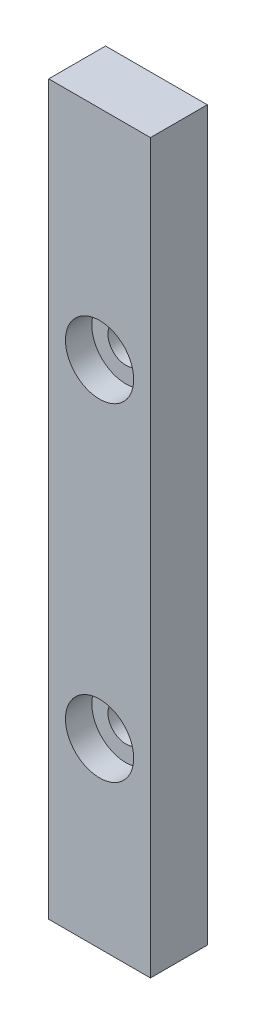
ISO-10303-21;
HEADER;
FILE_DESCRIPTION(('STEP AP214'),'2;1');
FILE_NAME('part.step','',(''),(''),'','','');
FILE_SCHEMA(('AUTOMOTIVE_DESIGN { 1 0 10303 214 1 1 1 1 }'));
ENDSEC;
DATA;
#1=APPLICATION_CONTEXT('core data for automotive mechanical design processes');
#2=APPLICATION_PROTOCOL_DEFINITION('international standard','automotive_design',2000,#1);
#3=PRODUCT_CONTEXT('',#1,'mechanical');
#4=PRODUCT('Part','Part','',(#3));
#5=PRODUCT_RELATED_PRODUCT_CATEGORY('part','',(#4));
#6=PRODUCT_DEFINITION_FORMATION('','',#4);
#7=PRODUCT_DEFINITION_CONTEXT('part definition',#1,'design');
#8=PRODUCT_DEFINITION('design','',#6,#7);
#9=PRODUCT_DEFINITION_SHAPE('','',#8);
#10=(LENGTH_UNIT() NAMED_UNIT(*) SI_UNIT(.MILLI.,.METRE.));
#11=(NAMED_UNIT(*) PLANE_ANGLE_UNIT() SI_UNIT($,.RADIAN.));
#12=(NAMED_UNIT(*) SI_UNIT($,.STERADIAN.) SOLID_ANGLE_UNIT());
#13=UNCERTAINTY_MEASURE_WITH_UNIT(LENGTH_MEASURE(1.E-05),#10,'distance_accuracy_value','');
#14=(GEOMETRIC_REPRESENTATION_CONTEXT(3) GLOBAL_UNCERTAINTY_ASSIGNED_CONTEXT((#13)) GLOBAL_UNIT_ASSIGNED_CONTEXT((#10,
#11,#12)) REPRESENTATION_CONTEXT('',''));
#15=CARTESIAN_POINT('',(0.,0.,0.));
#16=DIRECTION('',(0.,0.,1.));
#17=DIRECTION('',(1.,0.,0.));
#18=AXIS2_PLACEMENT_3D('',#15,#16,#17);
#19=CARTESIAN_POINT('',(4.25,-45.6,4.75));
#20=DIRECTION('',(0.,0.,1.));
#21=DIRECTION('',(1.,0.,0.));
#22=AXIS2_PLACEMENT_3D('',#19,#20,#21);
#23=CYLINDRICAL_SURFACE('',#22,1.5);
#24=CARTESIAN_POINT('',(4.25,-45.6,0.));
#25=DIRECTION('',(0.,0.,1.));
#26=DIRECTION('',(1.,0.,0.));
#27=AXIS2_PLACEMENT_3D('',#24,#25,#26);
#28=CIRCLE('',#27,1.5);
#29=CARTESIAN_POINT('',(5.75,-45.6,0.));
#30=VERTEX_POINT('',#29);
#31=EDGE_CURVE('E115',#30,#30,#28,.T.);
#32=ORIENTED_EDGE('',*,*,#31,.F.);
#33=EDGE_LOOP('',(#32));
#34=FACE_BOUND('',#33,.T.);
#35=CARTESIAN_POINT('',(4.25,-45.6,2.55));
#36=DIRECTION('',(0.,0.,1.));
#37=DIRECTION('',(1.,0.,0.));
#38=AXIS2_PLACEMENT_3D('',#35,#36,#37);
#39=CIRCLE('',#38,1.5);
#40=CARTESIAN_POINT('',(5.75,-45.6,2.55));
#41=VERTEX_POINT('',#40);
#42=EDGE_CURVE('E43',#41,#41,#39,.F.);
#43=ORIENTED_EDGE('',*,*,#42,.F.);
#44=EDGE_LOOP('',(#43));
#45=FACE_BOUND('',#44,.T.);
#46=ADVANCED_FACE('F39',(#34,#45),#23,.F.);
#47=CARTESIAN_POINT('',(4.25000000000001,-18.2,4.75));
#48=DIRECTION('',(0.,0.,1.));
#49=DIRECTION('',(1.,0.,0.));
#50=AXIS2_PLACEMENT_3D('',#47,#48,#49);
#51=CYLINDRICAL_SURFACE('',#50,1.5);
#52=CARTESIAN_POINT('',(4.25000000000001,-18.2,0.));
#53=DIRECTION('',(0.,0.,1.));
#54=DIRECTION('',(1.,0.,0.));
#55=AXIS2_PLACEMENT_3D('',#52,#53,#54);
#56=CIRCLE('',#55,1.5);
#57=CARTESIAN_POINT('',(5.75000000000001,-18.2,0.));
#58=VERTEX_POINT('',#57);
#59=EDGE_CURVE('E129',#58,#58,#56,.T.);
#60=ORIENTED_EDGE('',*,*,#59,.F.);
#61=EDGE_LOOP('',(#60));
#62=FACE_BOUND('',#61,.T.);
#63=CARTESIAN_POINT('',(4.25000000000001,-18.2,2.55));
#64=DIRECTION('',(0.,0.,1.));
#65=DIRECTION('',(1.,0.,0.));
#66=AXIS2_PLACEMENT_3D('',#63,#64,#65);
#67=CIRCLE('',#66,1.5);
#68=CARTESIAN_POINT('',(5.75000000000001,-18.2,2.55));
#69=VERTEX_POINT('',#68);
#70=EDGE_CURVE('E132',#69,#69,#67,.F.);
#71=ORIENTED_EDGE('',*,*,#70,.F.);
#72=EDGE_LOOP('',(#71));
#73=FACE_BOUND('',#72,.T.);
#74=ADVANCED_FACE('F178',(#62,#73),#51,.F.);
#75=CARTESIAN_POINT('',(0.,0.,4.75));
#76=DIRECTION('',(1.,0.,0.));
#77=DIRECTION('',(0.,1.,0.));
#78=AXIS2_PLACEMENT_3D('',#75,#76,#77);
#79=PLANE('',#78);
#80=DIRECTION('',(0.,-1.,0.));
#81=VECTOR('',#80,1.);
#82=CARTESIAN_POINT('',(0.,0.,0.));
#83=LINE('',#82,#81);
#84=CARTESIAN_POINT('',(0.,0.,0.));
#85=VERTEX_POINT('',#84);
#86=CARTESIAN_POINT('',(0.,-60.8,0.));
#87=VERTEX_POINT('',#86);
#88=EDGE_CURVE('E111',#85,#87,#83,.T.);
#89=ORIENTED_EDGE('',*,*,#88,.T.);
#90=DIRECTION('',(0.,0.,-1.));
#91=VECTOR('',#90,1.);
#92=CARTESIAN_POINT('',(0.,-60.8,4.75));
#93=LINE('',#92,#91);
#94=CARTESIAN_POINT('',(0.,-60.8,4.75));
#95=VERTEX_POINT('',#94);
#96=EDGE_CURVE('E11',#95,#87,#93,.T.);
#97=ORIENTED_EDGE('',*,*,#96,.F.);
#98=DIRECTION('',(0.,-1.,0.));
#99=VECTOR('',#98,1.);
#100=CARTESIAN_POINT('',(0.,0.,4.75));
#101=LINE('',#100,#99);
#102=CARTESIAN_POINT('',(0.,0.,4.75));
#103=VERTEX_POINT('',#102);
#104=EDGE_CURVE('E94',#103,#95,#101,.T.);
#105=ORIENTED_EDGE('',*,*,#104,.F.);
#106=DIRECTION('',(0.,0.,-1.));
#107=VECTOR('',#106,1.);
#108=CARTESIAN_POINT('',(0.,0.,4.75));
#109=LINE('',#108,#107);
#110=EDGE_CURVE('E107',#103,#85,#109,.T.);
#111=ORIENTED_EDGE('',*,*,#110,.T.);
#112=EDGE_LOOP('',(#89,#97,#105,#111));
#113=FACE_BOUND('',#112,.T.);
#114=ADVANCED_FACE('F41',(#113),#79,.F.);
#115=CARTESIAN_POINT('',(0.,-60.8,4.75));
#116=DIRECTION('',(0.,1.,0.));
#117=DIRECTION('',(0.,0.,1.));
#118=AXIS2_PLACEMENT_3D('',#115,#116,#117);
#119=PLANE('',#118);
#120=DIRECTION('',(1.,0.,0.));
#121=VECTOR('',#120,1.);
#122=CARTESIAN_POINT('',(0.,-60.8,0.));
#123=LINE('',#122,#121);
#124=CARTESIAN_POINT('',(8.50000000000001,-60.8,0.));
#125=VERTEX_POINT('',#124);
#126=EDGE_CURVE('E99',#87,#125,#123,.T.);
#127=ORIENTED_EDGE('',*,*,#126,.T.);
#128=DIRECTION('',(0.,0.,-1.));
#129=VECTOR('',#128,1.);
#130=CARTESIAN_POINT('',(8.50000000000001,-60.8,4.75));
#131=LINE('',#130,#129);
#132=CARTESIAN_POINT('',(8.50000000000001,-60.8,4.75));
#133=VERTEX_POINT('',#132);
#134=EDGE_CURVE('E50',#133,#125,#131,.T.);
#135=ORIENTED_EDGE('',*,*,#134,.F.);
#136=DIRECTION('',(1.,0.,0.));
#137=VECTOR('',#136,1.);
#138=CARTESIAN_POINT('',(0.,-60.8,4.75));
#139=LINE('',#138,#137);
#140=EDGE_CURVE('E89',#95,#133,#139,.T.);
#141=ORIENTED_EDGE('',*,*,#140,.F.);
#142=ORIENTED_EDGE('',*,*,#96,.T.);
#143=EDGE_LOOP('',(#127,#135,#141,#142));
#144=FACE_BOUND('',#143,.T.);
#145=ADVANCED_FACE('F98',(#144),#119,.F.);
#146=CARTESIAN_POINT('',(8.5,0.,4.75));
#147=DIRECTION('',(-1.,0.,0.));
#148=DIRECTION('',(0.,-1.,0.));
#149=AXIS2_PLACEMENT_3D('',#146,#147,#148);
#150=PLANE('',#149);
#151=DIRECTION('',(0.,1.,0.));
#152=VECTOR('',#151,1.);
#153=CARTESIAN_POINT('',(8.5,0.,0.));
#154=LINE('',#153,#152);
#155=CARTESIAN_POINT('',(8.5,0.,0.));
#156=VERTEX_POINT('',#155);
#157=EDGE_CURVE('E76',#125,#156,#154,.T.);
#158=ORIENTED_EDGE('',*,*,#157,.T.);
#159=DIRECTION('',(0.,0.,-1.));
#160=VECTOR('',#159,1.);
#161=CARTESIAN_POINT('',(8.5,0.,4.75));
#162=LINE('',#161,#160);
#163=CARTESIAN_POINT('',(8.5,0.,4.75));
#164=VERTEX_POINT('',#163);
#165=EDGE_CURVE('E101',#164,#156,#162,.T.);
#166=ORIENTED_EDGE('',*,*,#165,.F.);
#167=DIRECTION('',(0.,1.,0.));
#168=VECTOR('',#167,1.);
#169=CARTESIAN_POINT('',(8.5,0.,4.75));
#170=LINE('',#169,#168);
#171=EDGE_CURVE('E92',#133,#164,#170,.T.);
#172=ORIENTED_EDGE('',*,*,#171,.F.);
#173=ORIENTED_EDGE('',*,*,#134,.T.);
#174=EDGE_LOOP('',(#158,#166,#172,#173));
#175=FACE_BOUND('',#174,.T.);
#176=ADVANCED_FACE('F103',(#175),#150,.F.);
#177=CARTESIAN_POINT('',(0.,0.,4.75));
#178=DIRECTION('',(0.,-1.,0.));
#179=DIRECTION('',(0.,0.,-1.));
#180=AXIS2_PLACEMENT_3D('',#177,#178,#179);
#181=PLANE('',#180);
#182=DIRECTION('',(-1.,0.,0.));
#183=VECTOR('',#182,1.);
#184=CARTESIAN_POINT('',(0.,0.,0.));
#185=LINE('',#184,#183);
#186=EDGE_CURVE('E82',#156,#85,#185,.T.);
#187=ORIENTED_EDGE('',*,*,#186,.T.);
#188=ORIENTED_EDGE('',*,*,#110,.F.);
#189=DIRECTION('',(-1.,0.,0.));
#190=VECTOR('',#189,1.);
#191=CARTESIAN_POINT('',(0.,0.,4.75));
#192=LINE('',#191,#190);
#193=EDGE_CURVE('E59',#164,#103,#192,.T.);
#194=ORIENTED_EDGE('',*,*,#193,.F.);
#195=ORIENTED_EDGE('',*,*,#165,.T.);
#196=EDGE_LOOP('',(#187,#188,#194,#195));
#197=FACE_BOUND('',#196,.T.);
#198=ADVANCED_FACE('F164',(#197),#181,.F.);
#199=CARTESIAN_POINT('',(0.,0.,4.75));
#200=DIRECTION('',(0.,0.,1.));
#201=DIRECTION('',(1.,0.,0.));
#202=AXIS2_PLACEMENT_3D('',#199,#200,#201);
#203=PLANE('',#202);
#204=CARTESIAN_POINT('',(4.25000000000001,-18.2,4.75));
#205=DIRECTION('',(0.,0.,1.));
#206=DIRECTION('',(1.,0.,0.));
#207=AXIS2_PLACEMENT_3D('',#204,#205,#206);
#208=CIRCLE('',#207,2.85);
#209=CARTESIAN_POINT('',(7.10000000000001,-18.2,4.75));
#210=VERTEX_POINT('',#209);
#211=EDGE_CURVE('E142',#210,#210,#208,.T.);
#212=ORIENTED_EDGE('',*,*,#211,.F.);
#213=EDGE_LOOP('',(#212));
#214=FACE_BOUND('',#213,.T.);
#215=CARTESIAN_POINT('',(4.25,-45.6,4.75));
#216=DIRECTION('',(0.,0.,1.));
#217=DIRECTION('',(1.,0.,0.));
#218=AXIS2_PLACEMENT_3D('',#215,#216,#217);
#219=CIRCLE('',#218,2.85);
#220=CARTESIAN_POINT('',(7.1,-45.6,4.75));
#221=VERTEX_POINT('',#220);
#222=EDGE_CURVE('E154',#221,#221,#219,.T.);
#223=ORIENTED_EDGE('',*,*,#222,.F.);
#224=EDGE_LOOP('',(#223));
#225=FACE_BOUND('',#224,.T.);
#226=ORIENTED_EDGE('',*,*,#104,.T.);
#227=ORIENTED_EDGE('',*,*,#140,.T.);
#228=ORIENTED_EDGE('',*,*,#171,.T.);
#229=ORIENTED_EDGE('',*,*,#193,.T.);
#230=EDGE_LOOP('',(#226,#227,#228,#229));
#231=FACE_BOUND('',#230,.T.);
#232=ADVANCED_FACE('F90',(#214,#225,#231),#203,.T.);
#233=CARTESIAN_POINT('',(0.,0.,0.));
#234=DIRECTION('',(0.,0.,1.));
#235=DIRECTION('',(1.,0.,0.));
#236=AXIS2_PLACEMENT_3D('',#233,#234,#235);
#237=PLANE('',#236);
#238=ORIENTED_EDGE('',*,*,#59,.T.);
#239=EDGE_LOOP('',(#238));
#240=FACE_BOUND('',#239,.T.);
#241=ORIENTED_EDGE('',*,*,#31,.T.);
#242=EDGE_LOOP('',(#241));
#243=FACE_BOUND('',#242,.T.);
#244=ORIENTED_EDGE('',*,*,#88,.F.);
#245=ORIENTED_EDGE('',*,*,#186,.F.);
#246=ORIENTED_EDGE('',*,*,#157,.F.);
#247=ORIENTED_EDGE('',*,*,#126,.F.);
#248=EDGE_LOOP('',(#244,#245,#246,#247));
#249=FACE_BOUND('',#248,.T.);
#250=ADVANCED_FACE('F163',(#240,#243,#249),#237,.F.);
#251=CARTESIAN_POINT('',(4.25000000000001,-18.2,2.55));
#252=DIRECTION('',(0.,0.,1.));
#253=DIRECTION('',(1.,0.,0.));
#254=AXIS2_PLACEMENT_3D('',#251,#252,#253);
#255=PLANE('',#254);
#256=CARTESIAN_POINT('',(4.25000000000001,-18.2,2.55));
#257=DIRECTION('',(0.,0.,1.));
#258=DIRECTION('',(1.,0.,0.));
#259=AXIS2_PLACEMENT_3D('',#256,#257,#258);
#260=CIRCLE('',#259,2.85);
#261=CARTESIAN_POINT('',(7.10000000000001,-18.2,2.55));
#262=VERTEX_POINT('',#261);
#263=EDGE_CURVE('E135',#262,#262,#260,.T.);
#264=ORIENTED_EDGE('',*,*,#263,.T.);
#265=EDGE_LOOP('',(#264));
#266=FACE_BOUND('',#265,.T.);
#267=ORIENTED_EDGE('',*,*,#70,.T.);
#268=EDGE_LOOP('',(#267));
#269=FACE_BOUND('',#268,.T.);
#270=ADVANCED_FACE('F171',(#266,#269),#255,.T.);
#271=CARTESIAN_POINT('',(4.25000000000001,-18.2,2.55));
#272=DIRECTION('',(0.,0.,1.));
#273=DIRECTION('',(1.,0.,0.));
#274=AXIS2_PLACEMENT_3D('',#271,#272,#273);
#275=CYLINDRICAL_SURFACE('',#274,2.85);
#276=ORIENTED_EDGE('',*,*,#263,.F.);
#277=EDGE_LOOP('',(#276));
#278=FACE_BOUND('',#277,.T.);
#279=ORIENTED_EDGE('',*,*,#211,.T.);
#280=EDGE_LOOP('',(#279));
#281=FACE_BOUND('',#280,.T.);
#282=ADVANCED_FACE('F194',(#278,#281),#275,.F.);
#283=CARTESIAN_POINT('',(4.25,-45.6,2.55));
#284=DIRECTION('',(0.,0.,1.));
#285=DIRECTION('',(1.,0.,0.));
#286=AXIS2_PLACEMENT_3D('',#283,#284,#285);
#287=PLANE('',#286);
#288=CARTESIAN_POINT('',(4.25,-45.6,2.55));
#289=DIRECTION('',(0.,0.,1.));
#290=DIRECTION('',(1.,0.,0.));
#291=AXIS2_PLACEMENT_3D('',#288,#289,#290);
#292=CIRCLE('',#291,2.85);
#293=CARTESIAN_POINT('',(7.1,-45.6,2.55));
#294=VERTEX_POINT('',#293);
#295=EDGE_CURVE('E148',#294,#294,#292,.T.);
#296=ORIENTED_EDGE('',*,*,#295,.T.);
#297=EDGE_LOOP('',(#296));
#298=FACE_BOUND('',#297,.T.);
#299=ORIENTED_EDGE('',*,*,#42,.T.);
#300=EDGE_LOOP('',(#299));
#301=FACE_BOUND('',#300,.T.);
#302=ADVANCED_FACE('F190',(#298,#301),#287,.T.);
#303=CARTESIAN_POINT('',(4.25,-45.6,2.55));
#304=DIRECTION('',(0.,0.,1.));
#305=DIRECTION('',(1.,0.,0.));
#306=AXIS2_PLACEMENT_3D('',#303,#304,#305);
#307=CYLINDRICAL_SURFACE('',#306,2.85);
#308=ORIENTED_EDGE('',*,*,#295,.F.);
#309=EDGE_LOOP('',(#308));
#310=FACE_BOUND('',#309,.T.);
#311=ORIENTED_EDGE('',*,*,#222,.T.);
#312=EDGE_LOOP('',(#311));
#313=FACE_BOUND('',#312,.T.);
#314=ADVANCED_FACE('F160',(#310,#313),#307,.F.);
#315=CLOSED_SHELL('',(#46,#74,#114,#145,#176,#198,#232,#250,#270,#282,#302,#314));
#316=MANIFOLD_SOLID_BREP('B2',#315);
#317=ADVANCED_BREP_SHAPE_REPRESENTATION('',(#18,#316),#14);
#318=SHAPE_DEFINITION_REPRESENTATION(#9,#317);
ENDSEC;
END-ISO-10303-21;
